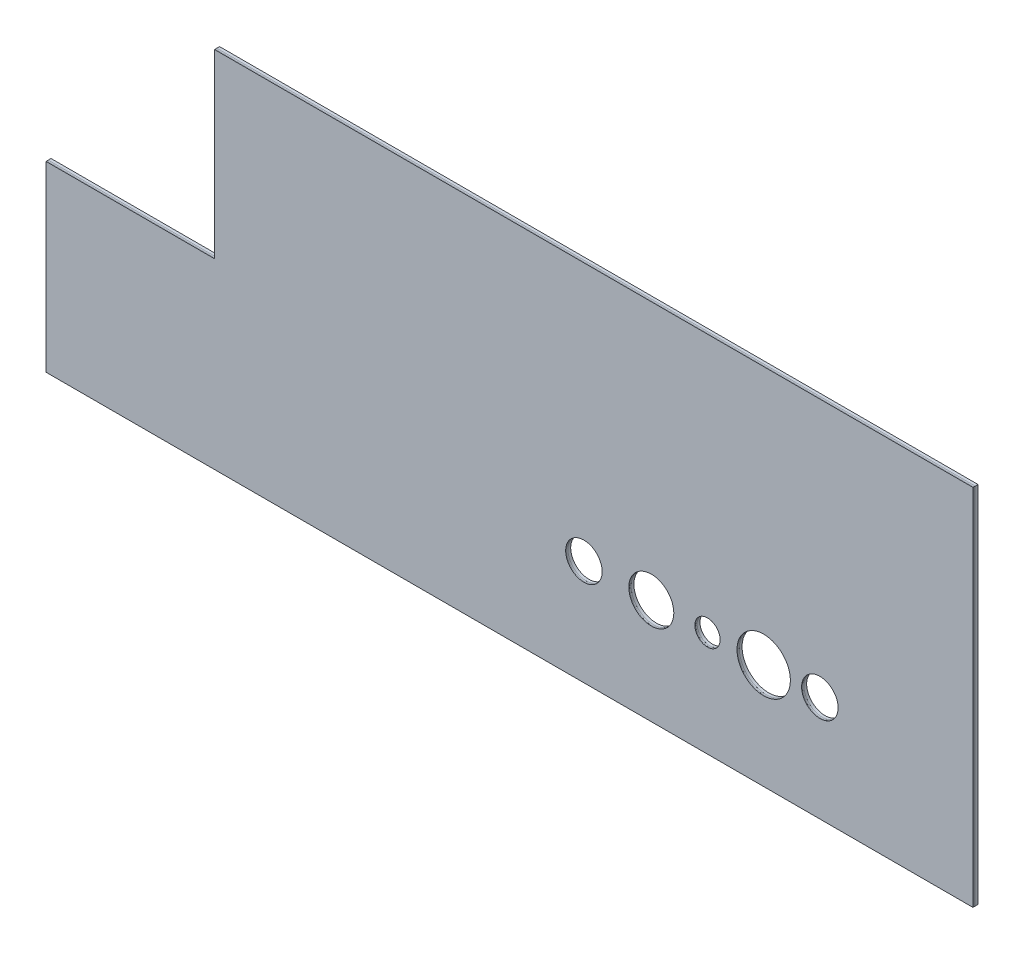
ISO-10303-21;
HEADER;
FILE_DESCRIPTION(('STEP AP214'),'2;1');
FILE_NAME('part.step','',(''),(''),'','','');
FILE_SCHEMA(('AUTOMOTIVE_DESIGN { 1 0 10303 214 1 1 1 1 }'));
ENDSEC;
DATA;
#1=APPLICATION_CONTEXT('core data for automotive mechanical design processes');
#2=APPLICATION_PROTOCOL_DEFINITION('international standard','automotive_design',2000,#1);
#3=PRODUCT_CONTEXT('',#1,'mechanical');
#4=PRODUCT('Part','Part','',(#3));
#5=PRODUCT_RELATED_PRODUCT_CATEGORY('part','',(#4));
#6=PRODUCT_DEFINITION_FORMATION('','',#4);
#7=PRODUCT_DEFINITION_CONTEXT('part definition',#1,'design');
#8=PRODUCT_DEFINITION('design','',#6,#7);
#9=PRODUCT_DEFINITION_SHAPE('','',#8);
#10=(LENGTH_UNIT() NAMED_UNIT(*) SI_UNIT(.MILLI.,.METRE.));
#11=(NAMED_UNIT(*) PLANE_ANGLE_UNIT() SI_UNIT($,.RADIAN.));
#12=(NAMED_UNIT(*) SI_UNIT($,.STERADIAN.) SOLID_ANGLE_UNIT());
#13=UNCERTAINTY_MEASURE_WITH_UNIT(LENGTH_MEASURE(1.E-05),#10,'distance_accuracy_value','');
#14=(GEOMETRIC_REPRESENTATION_CONTEXT(3) GLOBAL_UNCERTAINTY_ASSIGNED_CONTEXT((#13)) GLOBAL_UNIT_ASSIGNED_CONTEXT((#10,
#11,#12)) REPRESENTATION_CONTEXT('',''));
#15=CARTESIAN_POINT('',(0.,0.,0.));
#16=DIRECTION('',(0.,0.,1.));
#17=DIRECTION('',(1.,0.,0.));
#18=AXIS2_PLACEMENT_3D('',#15,#16,#17);
#19=CARTESIAN_POINT('',(-330.,0.,1.8));
#20=DIRECTION('',(0.,1.,0.));
#21=DIRECTION('',(-1.,0.,0.));
#22=AXIS2_PLACEMENT_3D('',#19,#20,#21);
#23=PLANE('',#22);
#24=DIRECTION('',(1.,0.,0.));
#25=VECTOR('',#24,1.);
#26=CARTESIAN_POINT('',(-330.,0.,1.5));
#27=LINE('',#26,#25);
#28=CARTESIAN_POINT('',(-330.,0.,1.5));
#29=VERTEX_POINT('',#28);
#30=CARTESIAN_POINT('',(0.,0.,1.5));
#31=VERTEX_POINT('',#30);
#32=EDGE_CURVE('E132',#29,#31,#27,.T.);
#33=ORIENTED_EDGE('',*,*,#32,.T.);
#34=DIRECTION('',(0.,0.,-1.));
#35=VECTOR('',#34,1.);
#36=CARTESIAN_POINT('',(0.,0.,1.8));
#37=LINE('',#36,#35);
#38=CARTESIAN_POINT('',(0.,0.,1.8));
#39=VERTEX_POINT('',#38);
#40=EDGE_CURVE('E12',#39,#31,#37,.T.);
#41=ORIENTED_EDGE('',*,*,#40,.F.);
#42=DIRECTION('',(1.,0.,0.));
#43=VECTOR('',#42,1.);
#44=CARTESIAN_POINT('',(-330.,0.,1.8));
#45=LINE('',#44,#43);
#46=CARTESIAN_POINT('',(-330.,0.,1.8));
#47=VERTEX_POINT('',#46);
#48=EDGE_CURVE('E142',#47,#39,#45,.T.);
#49=ORIENTED_EDGE('',*,*,#48,.F.);
#50=DIRECTION('',(0.,0.,-1.));
#51=VECTOR('',#50,1.);
#52=CARTESIAN_POINT('',(-330.,0.,1.8));
#53=LINE('',#52,#51);
#54=EDGE_CURVE('E128',#47,#29,#53,.T.);
#55=ORIENTED_EDGE('',*,*,#54,.T.);
#56=EDGE_LOOP('',(#33,#41,#49,#55));
#57=FACE_BOUND('',#56,.T.);
#58=ADVANCED_FACE('F46',(#57),#23,.F.);
#59=CARTESIAN_POINT('',(0.,0.,1.8));
#60=DIRECTION('',(-1.,0.,0.));
#61=DIRECTION('',(0.,0.,1.));
#62=AXIS2_PLACEMENT_3D('',#59,#60,#61);
#63=PLANE('',#62);
#64=DIRECTION('',(0.,1.,0.));
#65=VECTOR('',#64,1.);
#66=CARTESIAN_POINT('',(0.,0.,1.5));
#67=LINE('',#66,#65);
#68=CARTESIAN_POINT('',(0.,129.5,1.5));
#69=VERTEX_POINT('',#68);
#70=EDGE_CURVE('E135',#31,#69,#67,.T.);
#71=ORIENTED_EDGE('',*,*,#70,.T.);
#72=DIRECTION('',(0.,0.,-1.));
#73=VECTOR('',#72,1.);
#74=CARTESIAN_POINT('',(0.,129.5,1.8));
#75=LINE('',#74,#73);
#76=CARTESIAN_POINT('',(0.,129.5,1.8));
#77=VERTEX_POINT('',#76);
#78=EDGE_CURVE('E55',#77,#69,#75,.T.);
#79=ORIENTED_EDGE('',*,*,#78,.F.);
#80=DIRECTION('',(0.,1.,0.));
#81=VECTOR('',#80,1.);
#82=CARTESIAN_POINT('',(0.,0.,1.8));
#83=LINE('',#82,#81);
#84=EDGE_CURVE('E101',#39,#77,#83,.T.);
#85=ORIENTED_EDGE('',*,*,#84,.F.);
#86=ORIENTED_EDGE('',*,*,#40,.T.);
#87=EDGE_LOOP('',(#71,#79,#85,#86));
#88=FACE_BOUND('',#87,.T.);
#89=ADVANCED_FACE('F179',(#88),#63,.F.);
#90=CARTESIAN_POINT('',(0.,129.5,1.8));
#91=DIRECTION('',(0.,-1.,0.));
#92=DIRECTION('',(1.,0.,0.));
#93=AXIS2_PLACEMENT_3D('',#90,#91,#92);
#94=PLANE('',#93);
#95=DIRECTION('',(-1.,0.,0.));
#96=VECTOR('',#95,1.);
#97=CARTESIAN_POINT('',(0.,129.5,1.5));
#98=LINE('',#97,#96);
#99=CARTESIAN_POINT('',(-270.,129.5,1.5));
#100=VERTEX_POINT('',#99);
#101=EDGE_CURVE('E137',#69,#100,#98,.T.);
#102=ORIENTED_EDGE('',*,*,#101,.T.);
#103=DIRECTION('',(0.,0.,-1.));
#104=VECTOR('',#103,1.);
#105=CARTESIAN_POINT('',(-270.,129.5,1.8));
#106=LINE('',#105,#104);
#107=CARTESIAN_POINT('',(-270.,129.5,1.8));
#108=VERTEX_POINT('',#107);
#109=EDGE_CURVE('E123',#108,#100,#106,.T.);
#110=ORIENTED_EDGE('',*,*,#109,.F.);
#111=DIRECTION('',(-1.,0.,0.));
#112=VECTOR('',#111,1.);
#113=CARTESIAN_POINT('',(0.,129.5,1.8));
#114=LINE('',#113,#112);
#115=EDGE_CURVE('E114',#77,#108,#114,.T.);
#116=ORIENTED_EDGE('',*,*,#115,.F.);
#117=ORIENTED_EDGE('',*,*,#78,.T.);
#118=EDGE_LOOP('',(#102,#110,#116,#117));
#119=FACE_BOUND('',#118,.T.);
#120=ADVANCED_FACE('F184',(#119),#94,.F.);
#121=CARTESIAN_POINT('',(-270.,129.5,1.8));
#122=DIRECTION('',(1.,0.,0.));
#123=DIRECTION('',(0.,0.,-1.));
#124=AXIS2_PLACEMENT_3D('',#121,#122,#123);
#125=PLANE('',#124);
#126=DIRECTION('',(0.,-1.,0.));
#127=VECTOR('',#126,1.);
#128=CARTESIAN_POINT('',(-270.,129.5,1.5));
#129=LINE('',#128,#127);
#130=CARTESIAN_POINT('',(-270.,65.,1.5));
#131=VERTEX_POINT('',#130);
#132=EDGE_CURVE('E122',#100,#131,#129,.T.);
#133=ORIENTED_EDGE('',*,*,#132,.T.);
#134=DIRECTION('',(0.,0.,-1.));
#135=VECTOR('',#134,1.);
#136=CARTESIAN_POINT('',(-270.,65.,1.8));
#137=LINE('',#136,#135);
#138=CARTESIAN_POINT('',(-270.,65.,1.8));
#139=VERTEX_POINT('',#138);
#140=EDGE_CURVE('E119',#139,#131,#137,.T.);
#141=ORIENTED_EDGE('',*,*,#140,.F.);
#142=DIRECTION('',(0.,-1.,0.));
#143=VECTOR('',#142,1.);
#144=CARTESIAN_POINT('',(-270.,129.5,1.8));
#145=LINE('',#144,#143);
#146=EDGE_CURVE('E108',#108,#139,#145,.T.);
#147=ORIENTED_EDGE('',*,*,#146,.F.);
#148=ORIENTED_EDGE('',*,*,#109,.T.);
#149=EDGE_LOOP('',(#133,#141,#147,#148));
#150=FACE_BOUND('',#149,.T.);
#151=ADVANCED_FACE('F120',(#150),#125,.F.);
#152=CARTESIAN_POINT('',(-270.,65.,1.8));
#153=DIRECTION('',(0.,-1.,0.));
#154=DIRECTION('',(1.,0.,0.));
#155=AXIS2_PLACEMENT_3D('',#152,#153,#154);
#156=PLANE('',#155);
#157=DIRECTION('',(-1.,0.,0.));
#158=VECTOR('',#157,1.);
#159=CARTESIAN_POINT('',(-270.,65.,1.5));
#160=LINE('',#159,#158);
#161=CARTESIAN_POINT('',(-330.,65.,1.5));
#162=VERTEX_POINT('',#161);
#163=EDGE_CURVE('E87',#131,#162,#160,.T.);
#164=ORIENTED_EDGE('',*,*,#163,.T.);
#165=DIRECTION('',(0.,0.,-1.));
#166=VECTOR('',#165,1.);
#167=CARTESIAN_POINT('',(-330.,65.,1.8));
#168=LINE('',#167,#166);
#169=CARTESIAN_POINT('',(-330.,65.,1.8));
#170=VERTEX_POINT('',#169);
#171=EDGE_CURVE('E124',#170,#162,#168,.T.);
#172=ORIENTED_EDGE('',*,*,#171,.F.);
#173=DIRECTION('',(-1.,0.,0.));
#174=VECTOR('',#173,1.);
#175=CARTESIAN_POINT('',(-270.,65.,1.8));
#176=LINE('',#175,#174);
#177=EDGE_CURVE('E112',#139,#170,#176,.T.);
#178=ORIENTED_EDGE('',*,*,#177,.F.);
#179=ORIENTED_EDGE('',*,*,#140,.T.);
#180=EDGE_LOOP('',(#164,#172,#178,#179));
#181=FACE_BOUND('',#180,.T.);
#182=ADVANCED_FACE('F126',(#181),#156,.F.);
#183=CARTESIAN_POINT('',(-330.,65.,1.8));
#184=DIRECTION('',(1.,0.,0.));
#185=DIRECTION('',(0.,0.,-1.));
#186=AXIS2_PLACEMENT_3D('',#183,#184,#185);
#187=PLANE('',#186);
#188=DIRECTION('',(0.,-1.,0.));
#189=VECTOR('',#188,1.);
#190=CARTESIAN_POINT('',(-330.,65.,1.5));
#191=LINE('',#190,#189);
#192=EDGE_CURVE('E93',#162,#29,#191,.T.);
#193=ORIENTED_EDGE('',*,*,#192,.T.);
#194=ORIENTED_EDGE('',*,*,#54,.F.);
#195=DIRECTION('',(0.,-1.,0.));
#196=VECTOR('',#195,1.);
#197=CARTESIAN_POINT('',(-330.,65.,1.8));
#198=LINE('',#197,#196);
#199=EDGE_CURVE('E64',#170,#47,#198,.T.);
#200=ORIENTED_EDGE('',*,*,#199,.F.);
#201=ORIENTED_EDGE('',*,*,#171,.T.);
#202=EDGE_LOOP('',(#193,#194,#200,#201));
#203=FACE_BOUND('',#202,.T.);
#204=ADVANCED_FACE('F210',(#203),#187,.F.);
#205=CARTESIAN_POINT('',(0.,0.,1.8));
#206=DIRECTION('',(0.,0.,1.));
#207=DIRECTION('',(1.,0.,0.));
#208=AXIS2_PLACEMENT_3D('',#205,#206,#207);
#209=PLANE('',#208);
#210=CARTESIAN_POINT('',(-74.5,37.5,1.8));
#211=DIRECTION('',(0.,0.,1.));
#212=DIRECTION('',(1.,0.,0.));
#213=AXIS2_PLACEMENT_3D('',#210,#211,#212);
#214=CIRCLE('',#213,9.5);
#215=CARTESIAN_POINT('',(-65.,37.5,1.8));
#216=VERTEX_POINT('',#215);
#217=EDGE_CURVE('E152',#216,#216,#214,.T.);
#218=ORIENTED_EDGE('',*,*,#217,.F.);
#219=EDGE_LOOP('',(#218));
#220=FACE_BOUND('',#219,.T.);
#221=CARTESIAN_POINT('',(-94.5,37.5,1.8));
#222=DIRECTION('',(0.,0.,1.));
#223=DIRECTION('',(1.,0.,0.));
#224=AXIS2_PLACEMENT_3D('',#221,#222,#223);
#225=CIRCLE('',#224,4.50000000000001);
#226=CARTESIAN_POINT('',(-90.,37.5,1.8));
#227=VERTEX_POINT('',#226);
#228=EDGE_CURVE('E203',#227,#227,#225,.T.);
#229=ORIENTED_EDGE('',*,*,#228,.F.);
#230=EDGE_LOOP('',(#229));
#231=FACE_BOUND('',#230,.T.);
#232=CARTESIAN_POINT('',(-114.5,37.4999999999999,1.8));
#233=DIRECTION('',(0.,0.,1.));
#234=DIRECTION('',(1.,0.,0.));
#235=AXIS2_PLACEMENT_3D('',#232,#233,#234);
#236=CIRCLE('',#235,8.00000000000001);
#237=CARTESIAN_POINT('',(-106.5,37.4999999999999,1.8));
#238=VERTEX_POINT('',#237);
#239=EDGE_CURVE('E200',#238,#238,#236,.T.);
#240=ORIENTED_EDGE('',*,*,#239,.F.);
#241=EDGE_LOOP('',(#240));
#242=FACE_BOUND('',#241,.T.);
#243=CARTESIAN_POINT('',(-138.5,37.4999999999999,1.8));
#244=DIRECTION('',(0.,0.,1.));
#245=DIRECTION('',(1.,0.,0.));
#246=AXIS2_PLACEMENT_3D('',#243,#244,#245);
#247=CIRCLE('',#246,6.50000000000002);
#248=CARTESIAN_POINT('',(-132.,37.4999999999999,1.8));
#249=VERTEX_POINT('',#248);
#250=EDGE_CURVE('E197',#249,#249,#247,.T.);
#251=ORIENTED_EDGE('',*,*,#250,.F.);
#252=EDGE_LOOP('',(#251));
#253=FACE_BOUND('',#252,.T.);
#254=CARTESIAN_POINT('',(-54.5,37.5,1.8));
#255=DIRECTION('',(0.,0.,1.));
#256=DIRECTION('',(1.,0.,0.));
#257=AXIS2_PLACEMENT_3D('',#254,#255,#256);
#258=CIRCLE('',#257,6.5);
#259=CARTESIAN_POINT('',(-48.,37.5,1.8));
#260=VERTEX_POINT('',#259);
#261=EDGE_CURVE('E194',#260,#260,#258,.T.);
#262=ORIENTED_EDGE('',*,*,#261,.F.);
#263=EDGE_LOOP('',(#262));
#264=FACE_BOUND('',#263,.T.);
#265=ORIENTED_EDGE('',*,*,#48,.T.);
#266=ORIENTED_EDGE('',*,*,#84,.T.);
#267=ORIENTED_EDGE('',*,*,#115,.T.);
#268=ORIENTED_EDGE('',*,*,#146,.T.);
#269=ORIENTED_EDGE('',*,*,#177,.T.);
#270=ORIENTED_EDGE('',*,*,#199,.T.);
#271=EDGE_LOOP('',(#265,#266,#267,#268,#269,#270));
#272=FACE_BOUND('',#271,.T.);
#273=ADVANCED_FACE('F110',(#220,#231,#242,#253,#264,#272),#209,.T.);
#274=CARTESIAN_POINT('',(0.,0.,1.5));
#275=DIRECTION('',(0.,0.,1.));
#276=DIRECTION('',(1.,0.,0.));
#277=AXIS2_PLACEMENT_3D('',#274,#275,#276);
#278=PLANE('',#277);
#279=CARTESIAN_POINT('',(-74.5,37.5,1.5));
#280=DIRECTION('',(0.,0.,1.));
#281=DIRECTION('',(1.,0.,0.));
#282=AXIS2_PLACEMENT_3D('',#279,#280,#281);
#283=CIRCLE('',#282,9.5);
#284=CARTESIAN_POINT('',(-65.,37.5,1.5));
#285=VERTEX_POINT('',#284);
#286=EDGE_CURVE('E49',#285,#285,#283,.T.);
#287=ORIENTED_EDGE('',*,*,#286,.T.);
#288=EDGE_LOOP('',(#287));
#289=FACE_BOUND('',#288,.T.);
#290=CARTESIAN_POINT('',(-94.5,37.5,1.5));
#291=DIRECTION('',(0.,0.,1.));
#292=DIRECTION('',(1.,0.,0.));
#293=AXIS2_PLACEMENT_3D('',#290,#291,#292);
#294=CIRCLE('',#293,4.50000000000001);
#295=CARTESIAN_POINT('',(-90.,37.5,1.5));
#296=VERTEX_POINT('',#295);
#297=EDGE_CURVE('E157',#296,#296,#294,.T.);
#298=ORIENTED_EDGE('',*,*,#297,.T.);
#299=EDGE_LOOP('',(#298));
#300=FACE_BOUND('',#299,.T.);
#301=CARTESIAN_POINT('',(-114.5,37.4999999999999,1.5));
#302=DIRECTION('',(0.,0.,1.));
#303=DIRECTION('',(1.,0.,0.));
#304=AXIS2_PLACEMENT_3D('',#301,#302,#303);
#305=CIRCLE('',#304,8.00000000000001);
#306=CARTESIAN_POINT('',(-106.5,37.4999999999999,1.5));
#307=VERTEX_POINT('',#306);
#308=EDGE_CURVE('E155',#307,#307,#305,.T.);
#309=ORIENTED_EDGE('',*,*,#308,.T.);
#310=EDGE_LOOP('',(#309));
#311=FACE_BOUND('',#310,.T.);
#312=CARTESIAN_POINT('',(-138.5,37.4999999999999,1.5));
#313=DIRECTION('',(0.,0.,1.));
#314=DIRECTION('',(1.,0.,0.));
#315=AXIS2_PLACEMENT_3D('',#312,#313,#314);
#316=CIRCLE('',#315,6.50000000000002);
#317=CARTESIAN_POINT('',(-132.,37.4999999999999,1.5));
#318=VERTEX_POINT('',#317);
#319=EDGE_CURVE('E151',#318,#318,#316,.T.);
#320=ORIENTED_EDGE('',*,*,#319,.T.);
#321=EDGE_LOOP('',(#320));
#322=FACE_BOUND('',#321,.T.);
#323=CARTESIAN_POINT('',(-54.5,37.5,1.5));
#324=DIRECTION('',(0.,0.,1.));
#325=DIRECTION('',(1.,0.,0.));
#326=AXIS2_PLACEMENT_3D('',#323,#324,#325);
#327=CIRCLE('',#326,6.5);
#328=CARTESIAN_POINT('',(-48.,37.5,1.5));
#329=VERTEX_POINT('',#328);
#330=EDGE_CURVE('E148',#329,#329,#327,.T.);
#331=ORIENTED_EDGE('',*,*,#330,.T.);
#332=EDGE_LOOP('',(#331));
#333=FACE_BOUND('',#332,.T.);
#334=ORIENTED_EDGE('',*,*,#32,.F.);
#335=ORIENTED_EDGE('',*,*,#192,.F.);
#336=ORIENTED_EDGE('',*,*,#163,.F.);
#337=ORIENTED_EDGE('',*,*,#132,.F.);
#338=ORIENTED_EDGE('',*,*,#101,.F.);
#339=ORIENTED_EDGE('',*,*,#70,.F.);
#340=EDGE_LOOP('',(#334,#335,#336,#337,#338,#339));
#341=FACE_BOUND('',#340,.T.);
#342=ADVANCED_FACE('F164',(#289,#300,#311,#322,#333,#341),#278,.F.);
#343=CARTESIAN_POINT('',(-54.5,37.5,0.));
#344=DIRECTION('',(0.,0.,1.));
#345=DIRECTION('',(1.,0.,0.));
#346=AXIS2_PLACEMENT_3D('',#343,#344,#345);
#347=CYLINDRICAL_SURFACE('',#346,6.5);
#348=ORIENTED_EDGE('',*,*,#261,.T.);
#349=EDGE_LOOP('',(#348));
#350=FACE_BOUND('',#349,.T.);
#351=ORIENTED_EDGE('',*,*,#330,.F.);
#352=EDGE_LOOP('',(#351));
#353=FACE_BOUND('',#352,.T.);
#354=ADVANCED_FACE('F220',(#350,#353),#347,.F.);
#355=CARTESIAN_POINT('',(-138.5,37.4999999999999,0.));
#356=DIRECTION('',(0.,0.,1.));
#357=DIRECTION('',(1.,0.,0.));
#358=AXIS2_PLACEMENT_3D('',#355,#356,#357);
#359=CYLINDRICAL_SURFACE('',#358,6.50000000000002);
#360=ORIENTED_EDGE('',*,*,#250,.T.);
#361=EDGE_LOOP('',(#360));
#362=FACE_BOUND('',#361,.T.);
#363=ORIENTED_EDGE('',*,*,#319,.F.);
#364=EDGE_LOOP('',(#363));
#365=FACE_BOUND('',#364,.T.);
#366=ADVANCED_FACE('F223',(#362,#365),#359,.F.);
#367=CARTESIAN_POINT('',(-114.5,37.4999999999999,0.));
#368=DIRECTION('',(0.,0.,1.));
#369=DIRECTION('',(1.,0.,0.));
#370=AXIS2_PLACEMENT_3D('',#367,#368,#369);
#371=CYLINDRICAL_SURFACE('',#370,8.00000000000001);
#372=ORIENTED_EDGE('',*,*,#239,.T.);
#373=EDGE_LOOP('',(#372));
#374=FACE_BOUND('',#373,.T.);
#375=ORIENTED_EDGE('',*,*,#308,.F.);
#376=EDGE_LOOP('',(#375));
#377=FACE_BOUND('',#376,.T.);
#378=ADVANCED_FACE('F174',(#374,#377),#371,.F.);
#379=CARTESIAN_POINT('',(-94.5,37.5,0.));
#380=DIRECTION('',(0.,0.,1.));
#381=DIRECTION('',(1.,0.,0.));
#382=AXIS2_PLACEMENT_3D('',#379,#380,#381);
#383=CYLINDRICAL_SURFACE('',#382,4.50000000000001);
#384=ORIENTED_EDGE('',*,*,#228,.T.);
#385=EDGE_LOOP('',(#384));
#386=FACE_BOUND('',#385,.T.);
#387=ORIENTED_EDGE('',*,*,#297,.F.);
#388=EDGE_LOOP('',(#387));
#389=FACE_BOUND('',#388,.T.);
#390=ADVANCED_FACE('F168',(#386,#389),#383,.F.);
#391=CARTESIAN_POINT('',(-74.5,37.5,0.));
#392=DIRECTION('',(0.,0.,1.));
#393=DIRECTION('',(1.,0.,0.));
#394=AXIS2_PLACEMENT_3D('',#391,#392,#393);
#395=CYLINDRICAL_SURFACE('',#394,9.5);
#396=ORIENTED_EDGE('',*,*,#217,.T.);
#397=EDGE_LOOP('',(#396));
#398=FACE_BOUND('',#397,.T.);
#399=ORIENTED_EDGE('',*,*,#286,.F.);
#400=EDGE_LOOP('',(#399));
#401=FACE_BOUND('',#400,.T.);
#402=ADVANCED_FACE('F166',(#398,#401),#395,.F.);
#403=CLOSED_SHELL('',(#58,#89,#120,#151,#182,#204,#273,#342,#354,#366,#378,#390,#402));
#404=MANIFOLD_SOLID_BREP('B2',#403);
#405=CARTESIAN_POINT('',(0.,129.5,1.5));
#406=DIRECTION('',(-1.,0.,0.));
#407=DIRECTION('',(0.,0.,1.));
#408=AXIS2_PLACEMENT_3D('',#405,#406,#407);
#409=PLANE('',#408);
#410=DIRECTION('',(0.,1.,0.));
#411=VECTOR('',#410,1.);
#412=CARTESIAN_POINT('',(0.,129.5,1.));
#413=LINE('',#412,#411);
#414=CARTESIAN_POINT('',(0.,0.,1.));
#415=VERTEX_POINT('',#414);
#416=CARTESIAN_POINT('',(0.,129.5,1.));
#417=VERTEX_POINT('',#416);
#418=EDGE_CURVE('E422',#415,#417,#413,.T.);
#419=ORIENTED_EDGE('',*,*,#418,.T.);
#420=DIRECTION('',(0.,0.,-1.));
#421=VECTOR('',#420,1.);
#422=CARTESIAN_POINT('',(0.,129.5,1.5));
#423=LINE('',#422,#421);
#424=CARTESIAN_POINT('',(0.,129.5,1.5));
#425=VERTEX_POINT('',#424);
#426=EDGE_CURVE('E44',#425,#417,#423,.T.);
#427=ORIENTED_EDGE('',*,*,#426,.F.);
#428=DIRECTION('',(0.,1.,0.));
#429=VECTOR('',#428,1.);
#430=CARTESIAN_POINT('',(0.,129.5,1.5));
#431=LINE('',#430,#429);
#432=CARTESIAN_POINT('',(0.,0.,1.5));
#433=VERTEX_POINT('',#432);
#434=EDGE_CURVE('E433',#433,#425,#431,.T.);
#435=ORIENTED_EDGE('',*,*,#434,.F.);
#436=DIRECTION('',(0.,0.,-1.));
#437=VECTOR('',#436,1.);
#438=CARTESIAN_POINT('',(0.,0.,1.5));
#439=LINE('',#438,#437);
#440=EDGE_CURVE('E418',#433,#415,#439,.T.);
#441=ORIENTED_EDGE('',*,*,#440,.T.);
#442=EDGE_LOOP('',(#419,#427,#435,#441));
#443=FACE_BOUND('',#442,.T.);
#444=ADVANCED_FACE('F336',(#443),#409,.F.);
#445=CARTESIAN_POINT('',(-270.,129.5,1.5));
#446=DIRECTION('',(0.,-1.,0.));
#447=DIRECTION('',(1.,0.,0.));
#448=AXIS2_PLACEMENT_3D('',#445,#446,#447);
#449=PLANE('',#448);
#450=DIRECTION('',(-1.,0.,0.));
#451=VECTOR('',#450,1.);
#452=CARTESIAN_POINT('',(-270.,129.5,1.));
#453=LINE('',#452,#451);
#454=CARTESIAN_POINT('',(-270.,129.5,1.));
#455=VERTEX_POINT('',#454);
#456=EDGE_CURVE('E425',#417,#455,#453,.T.);
#457=ORIENTED_EDGE('',*,*,#456,.T.);
#458=DIRECTION('',(0.,0.,-1.));
#459=VECTOR('',#458,1.);
#460=CARTESIAN_POINT('',(-270.,129.5,1.5));
#461=LINE('',#460,#459);
#462=CARTESIAN_POINT('',(-270.,129.5,1.5));
#463=VERTEX_POINT('',#462);
#464=EDGE_CURVE('E345',#463,#455,#461,.T.);
#465=ORIENTED_EDGE('',*,*,#464,.F.);
#466=DIRECTION('',(-1.,0.,0.));
#467=VECTOR('',#466,1.);
#468=CARTESIAN_POINT('',(-270.,129.5,1.5));
#469=LINE('',#468,#467);
#470=EDGE_CURVE('E391',#425,#463,#469,.T.);
#471=ORIENTED_EDGE('',*,*,#470,.F.);
#472=ORIENTED_EDGE('',*,*,#426,.T.);
#473=EDGE_LOOP('',(#457,#465,#471,#472));
#474=FACE_BOUND('',#473,.T.);
#475=ADVANCED_FACE('F469',(#474),#449,.F.);
#476=CARTESIAN_POINT('',(-270.,65.,1.5));
#477=DIRECTION('',(1.,0.,0.));
#478=DIRECTION('',(0.,0.,-1.));
#479=AXIS2_PLACEMENT_3D('',#476,#477,#478);
#480=PLANE('',#479);
#481=DIRECTION('',(0.,-1.,0.));
#482=VECTOR('',#481,1.);
#483=CARTESIAN_POINT('',(-270.,65.,1.));
#484=LINE('',#483,#482);
#485=CARTESIAN_POINT('',(-270.,65.,1.));
#486=VERTEX_POINT('',#485);
#487=EDGE_CURVE('E428',#455,#486,#484,.T.);
#488=ORIENTED_EDGE('',*,*,#487,.T.);
#489=DIRECTION('',(0.,0.,-1.));
#490=VECTOR('',#489,1.);
#491=CARTESIAN_POINT('',(-270.,65.,1.5));
#492=LINE('',#491,#490);
#493=CARTESIAN_POINT('',(-270.,65.,1.5));
#494=VERTEX_POINT('',#493);
#495=EDGE_CURVE('E413',#494,#486,#492,.T.);
#496=ORIENTED_EDGE('',*,*,#495,.F.);
#497=DIRECTION('',(0.,-1.,0.));
#498=VECTOR('',#497,1.);
#499=CARTESIAN_POINT('',(-270.,65.,1.5));
#500=LINE('',#499,#498);
#501=EDGE_CURVE('E404',#463,#494,#500,.T.);
#502=ORIENTED_EDGE('',*,*,#501,.F.);
#503=ORIENTED_EDGE('',*,*,#464,.T.);
#504=EDGE_LOOP('',(#488,#496,#502,#503));
#505=FACE_BOUND('',#504,.T.);
#506=ADVANCED_FACE('F472',(#505),#480,.F.);
#507=CARTESIAN_POINT('',(-330.,65.,1.5));
#508=DIRECTION('',(0.,-1.,0.));
#509=DIRECTION('',(1.,0.,0.));
#510=AXIS2_PLACEMENT_3D('',#507,#508,#509);
#511=PLANE('',#510);
#512=DIRECTION('',(-1.,0.,0.));
#513=VECTOR('',#512,1.);
#514=CARTESIAN_POINT('',(-330.,65.,1.));
#515=LINE('',#514,#513);
#516=CARTESIAN_POINT('',(-330.,65.,1.));
#517=VERTEX_POINT('',#516);
#518=EDGE_CURVE('E412',#486,#517,#515,.T.);
#519=ORIENTED_EDGE('',*,*,#518,.T.);
#520=DIRECTION('',(0.,0.,-1.));
#521=VECTOR('',#520,1.);
#522=CARTESIAN_POINT('',(-330.,65.,1.5));
#523=LINE('',#522,#521);
#524=CARTESIAN_POINT('',(-330.,65.,1.5));
#525=VERTEX_POINT('',#524);
#526=EDGE_CURVE('E409',#525,#517,#523,.T.);
#527=ORIENTED_EDGE('',*,*,#526,.F.);
#528=DIRECTION('',(-1.,0.,0.));
#529=VECTOR('',#528,1.);
#530=CARTESIAN_POINT('',(-330.,65.,1.5));
#531=LINE('',#530,#529);
#532=EDGE_CURVE('E398',#494,#525,#531,.T.);
#533=ORIENTED_EDGE('',*,*,#532,.F.);
#534=ORIENTED_EDGE('',*,*,#495,.T.);
#535=EDGE_LOOP('',(#519,#527,#533,#534));
#536=FACE_BOUND('',#535,.T.);
#537=ADVANCED_FACE('F410',(#536),#511,.F.);
#538=CARTESIAN_POINT('',(-330.,0.,1.5));
#539=DIRECTION('',(1.,0.,0.));
#540=DIRECTION('',(0.,0.,-1.));
#541=AXIS2_PLACEMENT_3D('',#538,#539,#540);
#542=PLANE('',#541);
#543=DIRECTION('',(0.,-1.,0.));
#544=VECTOR('',#543,1.);
#545=CARTESIAN_POINT('',(-330.,0.,1.));
#546=LINE('',#545,#544);
#547=CARTESIAN_POINT('',(-330.,0.,1.));
#548=VERTEX_POINT('',#547);
#549=EDGE_CURVE('E377',#517,#548,#546,.T.);
#550=ORIENTED_EDGE('',*,*,#549,.T.);
#551=DIRECTION('',(0.,0.,-1.));
#552=VECTOR('',#551,1.);
#553=CARTESIAN_POINT('',(-330.,0.,1.5));
#554=LINE('',#553,#552);
#555=CARTESIAN_POINT('',(-330.,0.,1.5));
#556=VERTEX_POINT('',#555);
#557=EDGE_CURVE('E414',#556,#548,#554,.T.);
#558=ORIENTED_EDGE('',*,*,#557,.F.);
#559=DIRECTION('',(0.,-1.,0.));
#560=VECTOR('',#559,1.);
#561=CARTESIAN_POINT('',(-330.,0.,1.5));
#562=LINE('',#561,#560);
#563=EDGE_CURVE('E402',#525,#556,#562,.T.);
#564=ORIENTED_EDGE('',*,*,#563,.F.);
#565=ORIENTED_EDGE('',*,*,#526,.T.);
#566=EDGE_LOOP('',(#550,#558,#564,#565));
#567=FACE_BOUND('',#566,.T.);
#568=ADVANCED_FACE('F416',(#567),#542,.F.);
#569=CARTESIAN_POINT('',(0.,0.,1.5));
#570=DIRECTION('',(0.,1.,0.));
#571=DIRECTION('',(-1.,0.,0.));
#572=AXIS2_PLACEMENT_3D('',#569,#570,#571);
#573=PLANE('',#572);
#574=DIRECTION('',(1.,0.,0.));
#575=VECTOR('',#574,1.);
#576=CARTESIAN_POINT('',(0.,0.,1.));
#577=LINE('',#576,#575);
#578=EDGE_CURVE('E383',#548,#415,#577,.T.);
#579=ORIENTED_EDGE('',*,*,#578,.T.);
#580=ORIENTED_EDGE('',*,*,#440,.F.);
#581=DIRECTION('',(1.,0.,0.));
#582=VECTOR('',#581,1.);
#583=CARTESIAN_POINT('',(0.,0.,1.5));
#584=LINE('',#583,#582);
#585=EDGE_CURVE('E354',#556,#433,#584,.T.);
#586=ORIENTED_EDGE('',*,*,#585,.F.);
#587=ORIENTED_EDGE('',*,*,#557,.T.);
#588=EDGE_LOOP('',(#579,#580,#586,#587));
#589=FACE_BOUND('',#588,.T.);
#590=ADVANCED_FACE('F477',(#589),#573,.F.);
#591=CARTESIAN_POINT('',(0.,0.,1.5));
#592=DIRECTION('',(0.,0.,-1.));
#593=DIRECTION('',(-1.,0.,0.));
#594=AXIS2_PLACEMENT_3D('',#591,#592,#593);
#595=PLANE('',#594);
#596=CARTESIAN_POINT('',(-74.5,37.5,1.5));
#597=DIRECTION('',(0.,0.,-1.));
#598=DIRECTION('',(-1.,0.,0.));
#599=AXIS2_PLACEMENT_3D('',#596,#597,#598);
#600=CIRCLE('',#599,9.5);
#601=CARTESIAN_POINT('',(-84.,37.5,1.5));
#602=VERTEX_POINT('',#601);
#603=EDGE_CURVE('E426',#602,#602,#600,.T.);
#604=ORIENTED_EDGE('',*,*,#603,.T.);
#605=EDGE_LOOP('',(#604));
#606=FACE_BOUND('',#605,.T.);
#607=CARTESIAN_POINT('',(-94.5,37.5,1.5));
#608=DIRECTION('',(0.,0.,-1.));
#609=DIRECTION('',(-1.,0.,0.));
#610=AXIS2_PLACEMENT_3D('',#607,#608,#609);
#611=CIRCLE('',#610,4.50000000000001);
#612=CARTESIAN_POINT('',(-99.,37.5,1.5));
#613=VERTEX_POINT('',#612);
#614=EDGE_CURVE('E452',#613,#613,#611,.T.);
#615=ORIENTED_EDGE('',*,*,#614,.T.);
#616=EDGE_LOOP('',(#615));
#617=FACE_BOUND('',#616,.T.);
#618=CARTESIAN_POINT('',(-114.5,37.4999999999999,1.5));
#619=DIRECTION('',(0.,0.,-1.));
#620=DIRECTION('',(-1.,0.,0.));
#621=AXIS2_PLACEMENT_3D('',#618,#619,#620);
#622=CIRCLE('',#621,8.00000000000001);
#623=CARTESIAN_POINT('',(-122.5,37.4999999999999,1.5));
#624=VERTEX_POINT('',#623);
#625=EDGE_CURVE('E449',#624,#624,#622,.T.);
#626=ORIENTED_EDGE('',*,*,#625,.T.);
#627=EDGE_LOOP('',(#626));
#628=FACE_BOUND('',#627,.T.);
#629=CARTESIAN_POINT('',(-138.5,37.4999999999999,1.5));
#630=DIRECTION('',(0.,0.,-1.));
#631=DIRECTION('',(-1.,0.,0.));
#632=AXIS2_PLACEMENT_3D('',#629,#630,#631);
#633=CIRCLE('',#632,6.50000000000002);
#634=CARTESIAN_POINT('',(-145.,37.4999999999999,1.5));
#635=VERTEX_POINT('',#634);
#636=EDGE_CURVE('E446',#635,#635,#633,.T.);
#637=ORIENTED_EDGE('',*,*,#636,.T.);
#638=EDGE_LOOP('',(#637));
#639=FACE_BOUND('',#638,.T.);
#640=CARTESIAN_POINT('',(-54.5,37.5,1.5));
#641=DIRECTION('',(0.,0.,-1.));
#642=DIRECTION('',(-1.,0.,0.));
#643=AXIS2_PLACEMENT_3D('',#640,#641,#642);
#644=CIRCLE('',#643,6.5);
#645=CARTESIAN_POINT('',(-61.,37.5,1.5));
#646=VERTEX_POINT('',#645);
#647=EDGE_CURVE('E442',#646,#646,#644,.T.);
#648=ORIENTED_EDGE('',*,*,#647,.T.);
#649=EDGE_LOOP('',(#648));
#650=FACE_BOUND('',#649,.T.);
#651=ORIENTED_EDGE('',*,*,#434,.T.);
#652=ORIENTED_EDGE('',*,*,#470,.T.);
#653=ORIENTED_EDGE('',*,*,#501,.T.);
#654=ORIENTED_EDGE('',*,*,#532,.T.);
#655=ORIENTED_EDGE('',*,*,#563,.T.);
#656=ORIENTED_EDGE('',*,*,#585,.T.);
#657=EDGE_LOOP('',(#651,#652,#653,#654,#655,#656));
#658=FACE_BOUND('',#657,.T.);
#659=ADVANCED_FACE('F400',(#606,#617,#628,#639,#650,#658),#595,.F.);
#660=CARTESIAN_POINT('',(0.,0.,1.));
#661=DIRECTION('',(0.,0.,-1.));
#662=DIRECTION('',(-1.,0.,0.));
#663=AXIS2_PLACEMENT_3D('',#660,#661,#662);
#664=PLANE('',#663);
#665=CARTESIAN_POINT('',(-74.5,37.5,1.));
#666=DIRECTION('',(0.,0.,-1.));
#667=DIRECTION('',(-1.,0.,0.));
#668=AXIS2_PLACEMENT_3D('',#665,#666,#667);
#669=CIRCLE('',#668,9.5);
#670=CARTESIAN_POINT('',(-84.,37.5,1.));
#671=VERTEX_POINT('',#670);
#672=EDGE_CURVE('E339',#671,#671,#669,.T.);
#673=ORIENTED_EDGE('',*,*,#672,.F.);
#674=EDGE_LOOP('',(#673));
#675=FACE_BOUND('',#674,.T.);
#676=CARTESIAN_POINT('',(-94.5,37.5,1.));
#677=DIRECTION('',(0.,0.,-1.));
#678=DIRECTION('',(-1.,0.,0.));
#679=AXIS2_PLACEMENT_3D('',#676,#677,#678);
#680=CIRCLE('',#679,4.50000000000001);
#681=CARTESIAN_POINT('',(-99.,37.5,1.));
#682=VERTEX_POINT('',#681);
#683=EDGE_CURVE('E450',#682,#682,#680,.T.);
#684=ORIENTED_EDGE('',*,*,#683,.F.);
#685=EDGE_LOOP('',(#684));
#686=FACE_BOUND('',#685,.T.);
#687=CARTESIAN_POINT('',(-114.5,37.4999999999999,1.));
#688=DIRECTION('',(0.,0.,-1.));
#689=DIRECTION('',(-1.,0.,0.));
#690=AXIS2_PLACEMENT_3D('',#687,#688,#689);
#691=CIRCLE('',#690,8.00000000000001);
#692=CARTESIAN_POINT('',(-122.5,37.4999999999999,1.));
#693=VERTEX_POINT('',#692);
#694=EDGE_CURVE('E447',#693,#693,#691,.T.);
#695=ORIENTED_EDGE('',*,*,#694,.F.);
#696=EDGE_LOOP('',(#695));
#697=FACE_BOUND('',#696,.T.);
#698=CARTESIAN_POINT('',(-138.5,37.4999999999999,1.));
#699=DIRECTION('',(0.,0.,-1.));
#700=DIRECTION('',(-1.,0.,0.));
#701=AXIS2_PLACEMENT_3D('',#698,#699,#700);
#702=CIRCLE('',#701,6.50000000000002);
#703=CARTESIAN_POINT('',(-145.,37.4999999999999,1.));
#704=VERTEX_POINT('',#703);
#705=EDGE_CURVE('E443',#704,#704,#702,.T.);
#706=ORIENTED_EDGE('',*,*,#705,.F.);
#707=EDGE_LOOP('',(#706));
#708=FACE_BOUND('',#707,.T.);
#709=CARTESIAN_POINT('',(-54.5,37.5,1.));
#710=DIRECTION('',(0.,0.,-1.));
#711=DIRECTION('',(-1.,0.,0.));
#712=AXIS2_PLACEMENT_3D('',#709,#710,#711);
#713=CIRCLE('',#712,6.5);
#714=CARTESIAN_POINT('',(-61.,37.5,1.));
#715=VERTEX_POINT('',#714);
#716=EDGE_CURVE('E439',#715,#715,#713,.T.);
#717=ORIENTED_EDGE('',*,*,#716,.F.);
#718=EDGE_LOOP('',(#717));
#719=FACE_BOUND('',#718,.T.);
#720=ORIENTED_EDGE('',*,*,#418,.F.);
#721=ORIENTED_EDGE('',*,*,#578,.F.);
#722=ORIENTED_EDGE('',*,*,#549,.F.);
#723=ORIENTED_EDGE('',*,*,#518,.F.);
#724=ORIENTED_EDGE('',*,*,#487,.F.);
#725=ORIENTED_EDGE('',*,*,#456,.F.);
#726=EDGE_LOOP('',(#720,#721,#722,#723,#724,#725));
#727=FACE_BOUND('',#726,.T.);
#728=ADVANCED_FACE('F475',(#675,#686,#697,#708,#719,#727),#664,.T.);
#729=CARTESIAN_POINT('',(-54.5,37.5,0.));
#730=DIRECTION('',(0.,0.,1.));
#731=DIRECTION('',(1.,0.,0.));
#732=AXIS2_PLACEMENT_3D('',#729,#730,#731);
#733=CYLINDRICAL_SURFACE('',#732,6.5);
#734=ORIENTED_EDGE('',*,*,#716,.T.);
#735=EDGE_LOOP('',(#734));
#736=FACE_BOUND('',#735,.T.);
#737=ORIENTED_EDGE('',*,*,#647,.F.);
#738=EDGE_LOOP('',(#737));
#739=FACE_BOUND('',#738,.T.);
#740=ADVANCED_FACE('F525',(#736,#739),#733,.F.);
#741=CARTESIAN_POINT('',(-138.5,37.4999999999999,0.));
#742=DIRECTION('',(0.,0.,1.));
#743=DIRECTION('',(1.,0.,0.));
#744=AXIS2_PLACEMENT_3D('',#741,#742,#743);
#745=CYLINDRICAL_SURFACE('',#744,6.50000000000002);
#746=ORIENTED_EDGE('',*,*,#705,.T.);
#747=EDGE_LOOP('',(#746));
#748=FACE_BOUND('',#747,.T.);
#749=ORIENTED_EDGE('',*,*,#636,.F.);
#750=EDGE_LOOP('',(#749));
#751=FACE_BOUND('',#750,.T.);
#752=ADVANCED_FACE('F534',(#748,#751),#745,.F.);
#753=CARTESIAN_POINT('',(-114.5,37.4999999999999,0.));
#754=DIRECTION('',(0.,0.,1.));
#755=DIRECTION('',(1.,0.,0.));
#756=AXIS2_PLACEMENT_3D('',#753,#754,#755);
#757=CYLINDRICAL_SURFACE('',#756,8.00000000000001);
#758=ORIENTED_EDGE('',*,*,#694,.T.);
#759=EDGE_LOOP('',(#758));
#760=FACE_BOUND('',#759,.T.);
#761=ORIENTED_EDGE('',*,*,#625,.F.);
#762=EDGE_LOOP('',(#761));
#763=FACE_BOUND('',#762,.T.);
#764=ADVANCED_FACE('F544',(#760,#763),#757,.F.);
#765=CARTESIAN_POINT('',(-94.5,37.5,0.));
#766=DIRECTION('',(0.,0.,1.));
#767=DIRECTION('',(1.,0.,0.));
#768=AXIS2_PLACEMENT_3D('',#765,#766,#767);
#769=CYLINDRICAL_SURFACE('',#768,4.50000000000001);
#770=ORIENTED_EDGE('',*,*,#683,.T.);
#771=EDGE_LOOP('',(#770));
#772=FACE_BOUND('',#771,.T.);
#773=ORIENTED_EDGE('',*,*,#614,.F.);
#774=EDGE_LOOP('',(#773));
#775=FACE_BOUND('',#774,.T.);
#776=ADVANCED_FACE('F554',(#772,#775),#769,.F.);
#777=CARTESIAN_POINT('',(-74.5,37.5,0.));
#778=DIRECTION('',(0.,0.,1.));
#779=DIRECTION('',(1.,0.,0.));
#780=AXIS2_PLACEMENT_3D('',#777,#778,#779);
#781=CYLINDRICAL_SURFACE('',#780,9.5);
#782=ORIENTED_EDGE('',*,*,#672,.T.);
#783=EDGE_LOOP('',(#782));
#784=FACE_BOUND('',#783,.T.);
#785=ORIENTED_EDGE('',*,*,#603,.F.);
#786=EDGE_LOOP('',(#785));
#787=FACE_BOUND('',#786,.T.);
#788=ADVANCED_FACE('F564',(#784,#787),#781,.F.);
#789=CLOSED_SHELL('',(#444,#475,#506,#537,#568,#590,#659,#728,#740,#752,#764,#776,#788));
#790=MANIFOLD_SOLID_BREP('B6',#789);
#791=CARTESIAN_POINT('',(0.,0.,1.));
#792=DIRECTION('',(0.,1.,0.));
#793=DIRECTION('',(-1.,0.,0.));
#794=AXIS2_PLACEMENT_3D('',#791,#792,#793);
#795=PLANE('',#794);
#796=DIRECTION('',(1.,0.,0.));
#797=VECTOR('',#796,1.);
#798=CARTESIAN_POINT('',(0.,0.,0.));
#799=LINE('',#798,#797);
#800=CARTESIAN_POINT('',(-330.,0.,0.));
#801=VERTEX_POINT('',#800);
#802=CARTESIAN_POINT('',(0.,0.,0.));
#803=VERTEX_POINT('',#802);
#804=EDGE_CURVE('E701',#801,#803,#799,.T.);
#805=ORIENTED_EDGE('',*,*,#804,.T.);
#806=DIRECTION('',(0.,0.,-1.));
#807=VECTOR('',#806,1.);
#808=CARTESIAN_POINT('',(0.,0.,1.));
#809=LINE('',#808,#807);
#810=CARTESIAN_POINT('',(0.,0.,1.));
#811=VERTEX_POINT('',#810);
#812=EDGE_CURVE('E334',#811,#803,#809,.T.);
#813=ORIENTED_EDGE('',*,*,#812,.F.);
#814=DIRECTION('',(1.,0.,0.));
#815=VECTOR('',#814,1.);
#816=CARTESIAN_POINT('',(0.,0.,1.));
#817=LINE('',#816,#815);
#818=CARTESIAN_POINT('',(-330.,0.,1.));
#819=VERTEX_POINT('',#818);
#820=EDGE_CURVE('E712',#819,#811,#817,.T.);
#821=ORIENTED_EDGE('',*,*,#820,.F.);
#822=DIRECTION('',(0.,0.,-1.));
#823=VECTOR('',#822,1.);
#824=CARTESIAN_POINT('',(-330.,0.,1.));
#825=LINE('',#824,#823);
#826=EDGE_CURVE('E697',#819,#801,#825,.T.);
#827=ORIENTED_EDGE('',*,*,#826,.T.);
#828=EDGE_LOOP('',(#805,#813,#821,#827));
#829=FACE_BOUND('',#828,.T.);
#830=ADVANCED_FACE('F617',(#829),#795,.F.);
#831=CARTESIAN_POINT('',(0.,0.,1.));
#832=DIRECTION('',(-1.,0.,0.));
#833=DIRECTION('',(0.,0.,1.));
#834=AXIS2_PLACEMENT_3D('',#831,#832,#833);
#835=PLANE('',#834);
#836=DIRECTION('',(0.,1.,0.));
#837=VECTOR('',#836,1.);
#838=CARTESIAN_POINT('',(0.,0.,0.));
#839=LINE('',#838,#837);
#840=CARTESIAN_POINT('',(0.,129.5,0.));
#841=VERTEX_POINT('',#840);
#842=EDGE_CURVE('E704',#803,#841,#839,.T.);
#843=ORIENTED_EDGE('',*,*,#842,.T.);
#844=DIRECTION('',(0.,0.,-1.));
#845=VECTOR('',#844,1.);
#846=CARTESIAN_POINT('',(0.,129.5,1.));
#847=LINE('',#846,#845);
#848=CARTESIAN_POINT('',(0.,129.5,1.));
#849=VERTEX_POINT('',#848);
#850=EDGE_CURVE('E625',#849,#841,#847,.T.);
#851=ORIENTED_EDGE('',*,*,#850,.F.);
#852=DIRECTION('',(0.,1.,0.));
#853=VECTOR('',#852,1.);
#854=CARTESIAN_POINT('',(0.,0.,1.));
#855=LINE('',#854,#853);
#856=EDGE_CURVE('E670',#811,#849,#855,.T.);
#857=ORIENTED_EDGE('',*,*,#856,.F.);
#858=ORIENTED_EDGE('',*,*,#812,.T.);
#859=EDGE_LOOP('',(#843,#851,#857,#858));
#860=FACE_BOUND('',#859,.T.);
#861=ADVANCED_FACE('F737',(#860),#835,.F.);
#862=CARTESIAN_POINT('',(0.,129.5,1.));
#863=DIRECTION('',(0.,-1.,0.));
#864=DIRECTION('',(1.,0.,0.));
#865=AXIS2_PLACEMENT_3D('',#862,#863,#864);
#866=PLANE('',#865);
#867=DIRECTION('',(-1.,0.,0.));
#868=VECTOR('',#867,1.);
#869=CARTESIAN_POINT('',(0.,129.5,0.));
#870=LINE('',#869,#868);
#871=CARTESIAN_POINT('',(-270.,129.5,0.));
#872=VERTEX_POINT('',#871);
#873=EDGE_CURVE('E707',#841,#872,#870,.T.);
#874=ORIENTED_EDGE('',*,*,#873,.T.);
#875=DIRECTION('',(0.,0.,-1.));
#876=VECTOR('',#875,1.);
#877=CARTESIAN_POINT('',(-270.,129.5,1.));
#878=LINE('',#877,#876);
#879=CARTESIAN_POINT('',(-270.,129.5,1.));
#880=VERTEX_POINT('',#879);
#881=EDGE_CURVE('E692',#880,#872,#878,.T.);
#882=ORIENTED_EDGE('',*,*,#881,.F.);
#883=DIRECTION('',(-1.,0.,0.));
#884=VECTOR('',#883,1.);
#885=CARTESIAN_POINT('',(0.,129.5,1.));
#886=LINE('',#885,#884);
#887=EDGE_CURVE('E683',#849,#880,#886,.T.);
#888=ORIENTED_EDGE('',*,*,#887,.F.);
#889=ORIENTED_EDGE('',*,*,#850,.T.);
#890=EDGE_LOOP('',(#874,#882,#888,#889));
#891=FACE_BOUND('',#890,.T.);
#892=ADVANCED_FACE('F718',(#891),#866,.F.);
#893=CARTESIAN_POINT('',(-270.,129.5,1.));
#894=DIRECTION('',(1.,0.,0.));
#895=DIRECTION('',(0.,0.,-1.));
#896=AXIS2_PLACEMENT_3D('',#893,#894,#895);
#897=PLANE('',#896);
#898=DIRECTION('',(0.,-1.,0.));
#899=VECTOR('',#898,1.);
#900=CARTESIAN_POINT('',(-270.,129.5,0.));
#901=LINE('',#900,#899);
#902=CARTESIAN_POINT('',(-270.,65.,0.));
#903=VERTEX_POINT('',#902);
#904=EDGE_CURVE('E691',#872,#903,#901,.T.);
#905=ORIENTED_EDGE('',*,*,#904,.T.);
#906=DIRECTION('',(0.,0.,-1.));
#907=VECTOR('',#906,1.);
#908=CARTESIAN_POINT('',(-270.,65.,1.));
#909=LINE('',#908,#907);
#910=CARTESIAN_POINT('',(-270.,65.,1.));
#911=VERTEX_POINT('',#910);
#912=EDGE_CURVE('E688',#911,#903,#909,.T.);
#913=ORIENTED_EDGE('',*,*,#912,.F.);
#914=DIRECTION('',(0.,-1.,0.));
#915=VECTOR('',#914,1.);
#916=CARTESIAN_POINT('',(-270.,129.5,1.));
#917=LINE('',#916,#915);
#918=EDGE_CURVE('E677',#880,#911,#917,.T.);
#919=ORIENTED_EDGE('',*,*,#918,.F.);
#920=ORIENTED_EDGE('',*,*,#881,.T.);
#921=EDGE_LOOP('',(#905,#913,#919,#920));
#922=FACE_BOUND('',#921,.T.);
#923=ADVANCED_FACE('F689',(#922),#897,.F.);
#924=CARTESIAN_POINT('',(-270.,65.,1.));
#925=DIRECTION('',(0.,-1.,0.));
#926=DIRECTION('',(1.,0.,0.));
#927=AXIS2_PLACEMENT_3D('',#924,#925,#926);
#928=PLANE('',#927);
#929=DIRECTION('',(-1.,0.,0.));
#930=VECTOR('',#929,1.);
#931=CARTESIAN_POINT('',(-270.,65.,0.));
#932=LINE('',#931,#930);
#933=CARTESIAN_POINT('',(-330.,65.,0.));
#934=VERTEX_POINT('',#933);
#935=EDGE_CURVE('E656',#903,#934,#932,.T.);
#936=ORIENTED_EDGE('',*,*,#935,.T.);
#937=DIRECTION('',(0.,0.,-1.));
#938=VECTOR('',#937,1.);
#939=CARTESIAN_POINT('',(-330.,65.,1.));
#940=LINE('',#939,#938);
#941=CARTESIAN_POINT('',(-330.,65.,1.));
#942=VERTEX_POINT('',#941);
#943=EDGE_CURVE('E693',#942,#934,#940,.T.);
#944=ORIENTED_EDGE('',*,*,#943,.F.);
#945=DIRECTION('',(-1.,0.,0.));
#946=VECTOR('',#945,1.);
#947=CARTESIAN_POINT('',(-270.,65.,1.));
#948=LINE('',#947,#946);
#949=EDGE_CURVE('E681',#911,#942,#948,.T.);
#950=ORIENTED_EDGE('',*,*,#949,.F.);
#951=ORIENTED_EDGE('',*,*,#912,.T.);
#952=EDGE_LOOP('',(#936,#944,#950,#951));
#953=FACE_BOUND('',#952,.T.);
#954=ADVANCED_FACE('F695',(#953),#928,.F.);
#955=CARTESIAN_POINT('',(-330.,65.,1.));
#956=DIRECTION('',(1.,0.,0.));
#957=DIRECTION('',(0.,0.,-1.));
#958=AXIS2_PLACEMENT_3D('',#955,#956,#957);
#959=PLANE('',#958);
#960=DIRECTION('',(0.,-1.,0.));
#961=VECTOR('',#960,1.);
#962=CARTESIAN_POINT('',(-330.,65.,0.));
#963=LINE('',#962,#961);
#964=EDGE_CURVE('E662',#934,#801,#963,.T.);
#965=ORIENTED_EDGE('',*,*,#964,.T.);
#966=ORIENTED_EDGE('',*,*,#826,.F.);
#967=DIRECTION('',(0.,-1.,0.));
#968=VECTOR('',#967,1.);
#969=CARTESIAN_POINT('',(-330.,65.,1.));
#970=LINE('',#969,#968);
#971=EDGE_CURVE('E633',#942,#819,#970,.T.);
#972=ORIENTED_EDGE('',*,*,#971,.F.);
#973=ORIENTED_EDGE('',*,*,#943,.T.);
#974=EDGE_LOOP('',(#965,#966,#972,#973));
#975=FACE_BOUND('',#974,.T.);
#976=ADVANCED_FACE('F725',(#975),#959,.F.);
#977=CARTESIAN_POINT('',(0.,0.,1.));
#978=DIRECTION('',(0.,0.,1.));
#979=DIRECTION('',(1.,0.,0.));
#980=AXIS2_PLACEMENT_3D('',#977,#978,#979);
#981=PLANE('',#980);
#982=CARTESIAN_POINT('',(-74.5,37.5,1.));
#983=DIRECTION('',(0.,0.,1.));
#984=DIRECTION('',(1.,0.,0.));
#985=AXIS2_PLACEMENT_3D('',#982,#983,#984);
#986=CIRCLE('',#985,9.5);
#987=CARTESIAN_POINT('',(-65.,37.5,1.));
#988=VERTEX_POINT('',#987);
#989=EDGE_CURVE('E705',#988,#988,#986,.T.);
#990=ORIENTED_EDGE('',*,*,#989,.F.);
#991=EDGE_LOOP('',(#990));
#992=FACE_BOUND('',#991,.T.);
#993=CARTESIAN_POINT('',(-94.5,37.5,1.));
#994=DIRECTION('',(0.,0.,1.));
#995=DIRECTION('',(1.,0.,0.));
#996=AXIS2_PLACEMENT_3D('',#993,#994,#995);
#997=CIRCLE('',#996,4.50000000000001);
#998=CARTESIAN_POINT('',(-90.,37.5,1.));
#999=VERTEX_POINT('',#998);
#1000=EDGE_CURVE('E856',#999,#999,#997,.T.);
#1001=ORIENTED_EDGE('',*,*,#1000,.F.);
#1002=EDGE_LOOP('',(#1001));
#1003=FACE_BOUND('',#1002,.T.);
#1004=CARTESIAN_POINT('',(-114.5,37.4999999999999,1.));
#1005=DIRECTION('',(0.,0.,1.));
#1006=DIRECTION('',(1.,0.,0.));
#1007=AXIS2_PLACEMENT_3D('',#1004,#1005,#1006);
#1008=CIRCLE('',#1007,8.00000000000001);
#1009=CARTESIAN_POINT('',(-106.5,37.4999999999999,1.));
#1010=VERTEX_POINT('',#1009);
#1011=EDGE_CURVE('E853',#1010,#1010,#1008,.T.);
#1012=ORIENTED_EDGE('',*,*,#1011,.F.);
#1013=EDGE_LOOP('',(#1012));
#1014=FACE_BOUND('',#1013,.T.);
#1015=CARTESIAN_POINT('',(-138.5,37.4999999999999,1.));
#1016=DIRECTION('',(0.,0.,1.));
#1017=DIRECTION('',(1.,0.,0.));
#1018=AXIS2_PLACEMENT_3D('',#1015,#1016,#1017);
#1019=CIRCLE('',#1018,6.50000000000002);
#1020=CARTESIAN_POINT('',(-132.,37.4999999999999,1.));
#1021=VERTEX_POINT('',#1020);
#1022=EDGE_CURVE('E837',#1021,#1021,#1019,.T.);
#1023=ORIENTED_EDGE('',*,*,#1022,.F.);
#1024=EDGE_LOOP('',(#1023));
#1025=FACE_BOUND('',#1024,.T.);
#1026=CARTESIAN_POINT('',(-54.5,37.5,1.));
#1027=DIRECTION('',(0.,0.,1.));
#1028=DIRECTION('',(1.,0.,0.));
#1029=AXIS2_PLACEMENT_3D('',#1026,#1027,#1028);
#1030=CIRCLE('',#1029,6.5);
#1031=CARTESIAN_POINT('',(-48.,37.5,1.));
#1032=VERTEX_POINT('',#1031);
#1033=EDGE_CURVE('E833',#1032,#1032,#1030,.T.);
#1034=ORIENTED_EDGE('',*,*,#1033,.F.);
#1035=EDGE_LOOP('',(#1034));
#1036=FACE_BOUND('',#1035,.T.);
#1037=ORIENTED_EDGE('',*,*,#820,.T.);
#1038=ORIENTED_EDGE('',*,*,#856,.T.);
#1039=ORIENTED_EDGE('',*,*,#887,.T.);
#1040=ORIENTED_EDGE('',*,*,#918,.T.);
#1041=ORIENTED_EDGE('',*,*,#949,.T.);
#1042=ORIENTED_EDGE('',*,*,#971,.T.);
#1043=EDGE_LOOP('',(#1037,#1038,#1039,#1040,#1041,#1042));
#1044=FACE_BOUND('',#1043,.T.);
#1045=ADVANCED_FACE('F679',(#992,#1003,#1014,#1025,#1036,#1044),#981,.T.);
#1046=CARTESIAN_POINT('',(0.,0.,0.));
#1047=DIRECTION('',(0.,0.,1.));
#1048=DIRECTION('',(1.,0.,0.));
#1049=AXIS2_PLACEMENT_3D('',#1046,#1047,#1048);
#1050=PLANE('',#1049);
#1051=CARTESIAN_POINT('',(-74.5,37.5,0.));
#1052=DIRECTION('',(0.,0.,1.));
#1053=DIRECTION('',(1.,0.,0.));
#1054=AXIS2_PLACEMENT_3D('',#1051,#1052,#1053);
#1055=CIRCLE('',#1054,9.5);
#1056=CARTESIAN_POINT('',(-65.,37.5,0.));
#1057=VERTEX_POINT('',#1056);
#1058=EDGE_CURVE('E832',#1057,#1057,#1055,.T.);
#1059=ORIENTED_EDGE('',*,*,#1058,.T.);
#1060=EDGE_LOOP('',(#1059));
#1061=FACE_BOUND('',#1060,.T.);
#1062=CARTESIAN_POINT('',(-94.5,37.5,0.));
#1063=DIRECTION('',(0.,0.,1.));
#1064=DIRECTION('',(1.,0.,0.));
#1065=AXIS2_PLACEMENT_3D('',#1062,#1063,#1064);
#1066=CIRCLE('',#1065,4.50000000000001);
#1067=CARTESIAN_POINT('',(-90.,37.5,0.));
#1068=VERTEX_POINT('',#1067);
#1069=EDGE_CURVE('E834',#1068,#1068,#1066,.T.);
#1070=ORIENTED_EDGE('',*,*,#1069,.T.);
#1071=EDGE_LOOP('',(#1070));
#1072=FACE_BOUND('',#1071,.T.);
#1073=CARTESIAN_POINT('',(-114.5,37.4999999999999,0.));
#1074=DIRECTION('',(0.,0.,1.));
#1075=DIRECTION('',(1.,0.,0.));
#1076=AXIS2_PLACEMENT_3D('',#1073,#1074,#1075);
#1077=CIRCLE('',#1076,8.00000000000001);
#1078=CARTESIAN_POINT('',(-106.5,37.4999999999999,0.));
#1079=VERTEX_POINT('',#1078);
#1080=EDGE_CURVE('E840',#1079,#1079,#1077,.T.);
#1081=ORIENTED_EDGE('',*,*,#1080,.T.);
#1082=EDGE_LOOP('',(#1081));
#1083=FACE_BOUND('',#1082,.T.);
#1084=CARTESIAN_POINT('',(-138.5,37.4999999999999,0.));
#1085=DIRECTION('',(0.,0.,1.));
#1086=DIRECTION('',(1.,0.,0.));
#1087=AXIS2_PLACEMENT_3D('',#1084,#1085,#1086);
#1088=CIRCLE('',#1087,6.50000000000002);
#1089=CARTESIAN_POINT('',(-132.,37.4999999999999,0.));
#1090=VERTEX_POINT('',#1089);
#1091=EDGE_CURVE('E845',#1090,#1090,#1088,.T.);
#1092=ORIENTED_EDGE('',*,*,#1091,.T.);
#1093=EDGE_LOOP('',(#1092));
#1094=FACE_BOUND('',#1093,.T.);
#1095=CARTESIAN_POINT('',(-54.5,37.5,0.));
#1096=DIRECTION('',(0.,0.,1.));
#1097=DIRECTION('',(1.,0.,0.));
#1098=AXIS2_PLACEMENT_3D('',#1095,#1096,#1097);
#1099=CIRCLE('',#1098,6.5);
#1100=CARTESIAN_POINT('',(-48.,37.5,0.));
#1101=VERTEX_POINT('',#1100);
#1102=EDGE_CURVE('E848',#1101,#1101,#1099,.T.);
#1103=ORIENTED_EDGE('',*,*,#1102,.T.);
#1104=EDGE_LOOP('',(#1103));
#1105=FACE_BOUND('',#1104,.T.);
#1106=ORIENTED_EDGE('',*,*,#804,.F.);
#1107=ORIENTED_EDGE('',*,*,#964,.F.);
#1108=ORIENTED_EDGE('',*,*,#935,.F.);
#1109=ORIENTED_EDGE('',*,*,#904,.F.);
#1110=ORIENTED_EDGE('',*,*,#873,.F.);
#1111=ORIENTED_EDGE('',*,*,#842,.F.);
#1112=EDGE_LOOP('',(#1106,#1107,#1108,#1109,#1110,#1111));
#1113=FACE_BOUND('',#1112,.T.);
#1114=ADVANCED_FACE('F721',(#1061,#1072,#1083,#1094,#1105,#1113),#1050,.F.);
#1115=CARTESIAN_POINT('',(-54.5,37.5,0.));
#1116=DIRECTION('',(0.,0.,1.));
#1117=DIRECTION('',(1.,0.,0.));
#1118=AXIS2_PLACEMENT_3D('',#1115,#1116,#1117);
#1119=CYLINDRICAL_SURFACE('',#1118,6.5);
#1120=ORIENTED_EDGE('',*,*,#1033,.T.);
#1121=EDGE_LOOP('',(#1120));
#1122=FACE_BOUND('',#1121,.T.);
#1123=ORIENTED_EDGE('',*,*,#1102,.F.);
#1124=EDGE_LOOP('',(#1123));
#1125=FACE_BOUND('',#1124,.T.);
#1126=ADVANCED_FACE('F774',(#1122,#1125),#1119,.F.);
#1127=CARTESIAN_POINT('',(-138.5,37.4999999999999,0.));
#1128=DIRECTION('',(0.,0.,1.));
#1129=DIRECTION('',(1.,0.,0.));
#1130=AXIS2_PLACEMENT_3D('',#1127,#1128,#1129);
#1131=CYLINDRICAL_SURFACE('',#1130,6.50000000000002);
#1132=ORIENTED_EDGE('',*,*,#1022,.T.);
#1133=EDGE_LOOP('',(#1132));
#1134=FACE_BOUND('',#1133,.T.);
#1135=ORIENTED_EDGE('',*,*,#1091,.F.);
#1136=EDGE_LOOP('',(#1135));
#1137=FACE_BOUND('',#1136,.T.);
#1138=ADVANCED_FACE('F783',(#1134,#1137),#1131,.F.);
#1139=CARTESIAN_POINT('',(-114.5,37.4999999999999,0.));
#1140=DIRECTION('',(0.,0.,1.));
#1141=DIRECTION('',(1.,0.,0.));
#1142=AXIS2_PLACEMENT_3D('',#1139,#1140,#1141);
#1143=CYLINDRICAL_SURFACE('',#1142,8.00000000000001);
#1144=ORIENTED_EDGE('',*,*,#1011,.T.);
#1145=EDGE_LOOP('',(#1144));
#1146=FACE_BOUND('',#1145,.T.);
#1147=ORIENTED_EDGE('',*,*,#1080,.F.);
#1148=EDGE_LOOP('',(#1147));
#1149=FACE_BOUND('',#1148,.T.);
#1150=ADVANCED_FACE('F793',(#1146,#1149),#1143,.F.);
#1151=CARTESIAN_POINT('',(-94.5,37.5,0.));
#1152=DIRECTION('',(0.,0.,1.));
#1153=DIRECTION('',(1.,0.,0.));
#1154=AXIS2_PLACEMENT_3D('',#1151,#1152,#1153);
#1155=CYLINDRICAL_SURFACE('',#1154,4.50000000000001);
#1156=ORIENTED_EDGE('',*,*,#1000,.T.);
#1157=EDGE_LOOP('',(#1156));
#1158=FACE_BOUND('',#1157,.T.);
#1159=ORIENTED_EDGE('',*,*,#1069,.F.);
#1160=EDGE_LOOP('',(#1159));
#1161=FACE_BOUND('',#1160,.T.);
#1162=ADVANCED_FACE('F803',(#1158,#1161),#1155,.F.);
#1163=CARTESIAN_POINT('',(-74.5,37.5,0.));
#1164=DIRECTION('',(0.,0.,1.));
#1165=DIRECTION('',(1.,0.,0.));
#1166=AXIS2_PLACEMENT_3D('',#1163,#1164,#1165);
#1167=CYLINDRICAL_SURFACE('',#1166,9.5);
#1168=ORIENTED_EDGE('',*,*,#989,.T.);
#1169=EDGE_LOOP('',(#1168));
#1170=FACE_BOUND('',#1169,.T.);
#1171=ORIENTED_EDGE('',*,*,#1058,.F.);
#1172=EDGE_LOOP('',(#1171));
#1173=FACE_BOUND('',#1172,.T.);
#1174=ADVANCED_FACE('F813',(#1170,#1173),#1167,.F.);
#1175=CLOSED_SHELL('',(#830,#861,#892,#923,#954,#976,#1045,#1114,#1126,#1138,#1150,#1162,#1174));
#1176=MANIFOLD_SOLID_BREP('B38',#1175);
#1177=ADVANCED_BREP_SHAPE_REPRESENTATION('',(#18,#404,#790,#1176),#14);
#1178=SHAPE_DEFINITION_REPRESENTATION(#9,#1177);
ENDSEC;
END-ISO-10303-21;
